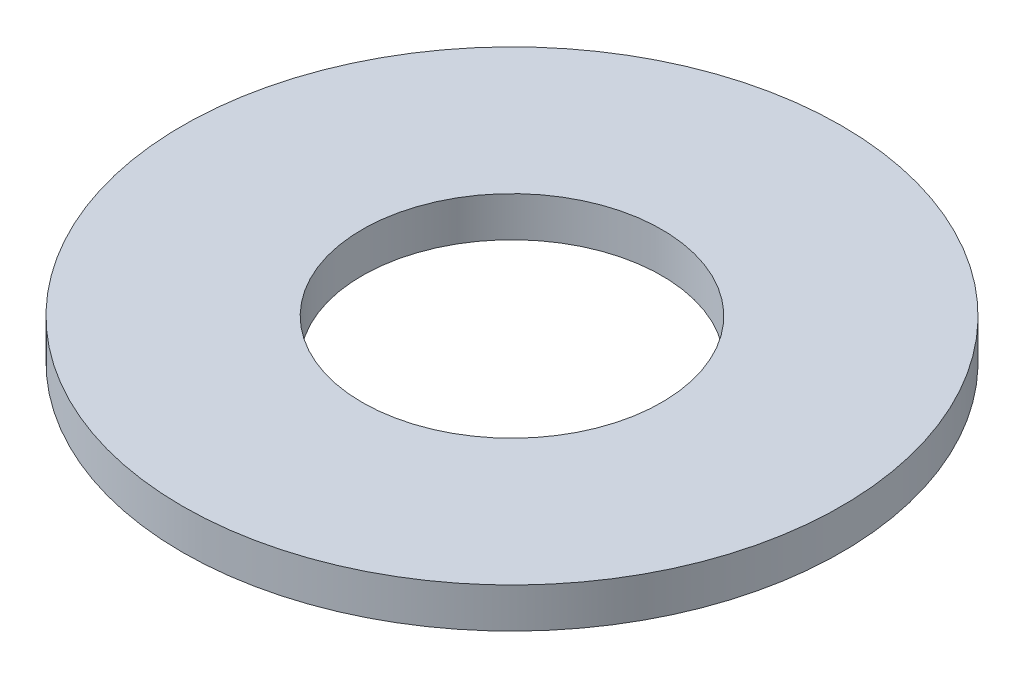
ISO-10303-21;
HEADER;
FILE_DESCRIPTION(('STEP AP214'),'2;1');
FILE_NAME('part.step','',(''),(''),'','','');
FILE_SCHEMA(('AUTOMOTIVE_DESIGN { 1 0 10303 214 1 1 1 1 }'));
ENDSEC;
DATA;
#1=APPLICATION_CONTEXT('core data for automotive mechanical design processes');
#2=APPLICATION_PROTOCOL_DEFINITION('international standard','automotive_design',2000,#1);
#3=PRODUCT_CONTEXT('',#1,'mechanical');
#4=PRODUCT('Part','Part','',(#3));
#5=PRODUCT_RELATED_PRODUCT_CATEGORY('part','',(#4));
#6=PRODUCT_DEFINITION_FORMATION('','',#4);
#7=PRODUCT_DEFINITION_CONTEXT('part definition',#1,'design');
#8=PRODUCT_DEFINITION('design','',#6,#7);
#9=PRODUCT_DEFINITION_SHAPE('','',#8);
#10=(LENGTH_UNIT() NAMED_UNIT(*) SI_UNIT(.MILLI.,.METRE.));
#11=(NAMED_UNIT(*) PLANE_ANGLE_UNIT() SI_UNIT($,.RADIAN.));
#12=(NAMED_UNIT(*) SI_UNIT($,.STERADIAN.) SOLID_ANGLE_UNIT());
#13=UNCERTAINTY_MEASURE_WITH_UNIT(LENGTH_MEASURE(1.E-05),#10,'distance_accuracy_value','');
#14=(GEOMETRIC_REPRESENTATION_CONTEXT(3) GLOBAL_UNCERTAINTY_ASSIGNED_CONTEXT((#13)) GLOBAL_UNIT_ASSIGNED_CONTEXT((#10,
#11,#12)) REPRESENTATION_CONTEXT('',''));
#15=CARTESIAN_POINT('',(0.,0.,0.));
#16=DIRECTION('',(0.,0.,1.));
#17=DIRECTION('',(1.,0.,0.));
#18=AXIS2_PLACEMENT_3D('',#15,#16,#17);
#19=CARTESIAN_POINT('',(0.,10.,0.));
#20=DIRECTION('',(0.,-1.,0.));
#21=DIRECTION('',(0.,0.,-1.));
#22=AXIS2_PLACEMENT_3D('',#19,#20,#21);
#23=CYLINDRICAL_SURFACE('',#22,82.5);
#24=CARTESIAN_POINT('',(0.,10.,0.));
#25=DIRECTION('',(0.,1.,0.));
#26=DIRECTION('',(0.,0.,1.));
#27=AXIS2_PLACEMENT_3D('',#24,#25,#26);
#28=CIRCLE('',#27,82.5);
#29=CARTESIAN_POINT('',(0.,10.,82.5));
#30=VERTEX_POINT('',#29);
#31=EDGE_CURVE('E10',#30,#30,#28,.T.);
#32=ORIENTED_EDGE('',*,*,#31,.F.);
#33=EDGE_LOOP('',(#32));
#34=FACE_BOUND('',#33,.T.);
#35=CARTESIAN_POINT('',(0.,0.,0.));
#36=DIRECTION('',(0.,1.,0.));
#37=DIRECTION('',(0.,0.,1.));
#38=AXIS2_PLACEMENT_3D('',#35,#36,#37);
#39=CIRCLE('',#38,82.5);
#40=CARTESIAN_POINT('',(0.,0.,82.5));
#41=VERTEX_POINT('',#40);
#42=EDGE_CURVE('E37',#41,#41,#39,.T.);
#43=ORIENTED_EDGE('',*,*,#42,.T.);
#44=EDGE_LOOP('',(#43));
#45=FACE_BOUND('',#44,.T.);
#46=ADVANCED_FACE('F40',(#34,#45),#23,.T.);
#47=CARTESIAN_POINT('',(0.,10.,0.));
#48=DIRECTION('',(0.,1.,0.));
#49=DIRECTION('',(0.,0.,1.));
#50=AXIS2_PLACEMENT_3D('',#47,#48,#49);
#51=PLANE('',#50);
#52=CARTESIAN_POINT('',(0.,10.,0.));
#53=DIRECTION('',(0.,1.,0.));
#54=DIRECTION('',(0.,0.,1.));
#55=AXIS2_PLACEMENT_3D('',#52,#53,#54);
#56=CIRCLE('',#55,37.5);
#57=CARTESIAN_POINT('',(0.,10.,37.5));
#58=VERTEX_POINT('',#57);
#59=EDGE_CURVE('E50',#58,#58,#56,.T.);
#60=ORIENTED_EDGE('',*,*,#59,.F.);
#61=EDGE_LOOP('',(#60));
#62=FACE_BOUND('',#61,.T.);
#63=ORIENTED_EDGE('',*,*,#31,.T.);
#64=EDGE_LOOP('',(#63));
#65=FACE_BOUND('',#64,.T.);
#66=ADVANCED_FACE('F59',(#62,#65),#51,.T.);
#67=CARTESIAN_POINT('',(0.,0.,0.));
#68=DIRECTION('',(0.,1.,0.));
#69=DIRECTION('',(0.,0.,1.));
#70=AXIS2_PLACEMENT_3D('',#67,#68,#69);
#71=PLANE('',#70);
#72=CARTESIAN_POINT('',(0.,0.,0.));
#73=DIRECTION('',(0.,1.,0.));
#74=DIRECTION('',(0.,0.,1.));
#75=AXIS2_PLACEMENT_3D('',#72,#73,#74);
#76=CIRCLE('',#75,37.5);
#77=CARTESIAN_POINT('',(0.,0.,37.5));
#78=VERTEX_POINT('',#77);
#79=EDGE_CURVE('E47',#78,#78,#76,.T.);
#80=ORIENTED_EDGE('',*,*,#79,.T.);
#81=EDGE_LOOP('',(#80));
#82=FACE_BOUND('',#81,.T.);
#83=ORIENTED_EDGE('',*,*,#42,.F.);
#84=EDGE_LOOP('',(#83));
#85=FACE_BOUND('',#84,.T.);
#86=ADVANCED_FACE('F58',(#82,#85),#71,.F.);
#87=CARTESIAN_POINT('',(0.,10.,0.));
#88=DIRECTION('',(0.,-1.,0.));
#89=DIRECTION('',(0.,0.,-1.));
#90=AXIS2_PLACEMENT_3D('',#87,#88,#89);
#91=CYLINDRICAL_SURFACE('',#90,37.5);
#92=ORIENTED_EDGE('',*,*,#59,.T.);
#93=EDGE_LOOP('',(#92));
#94=FACE_BOUND('',#93,.T.);
#95=ORIENTED_EDGE('',*,*,#79,.F.);
#96=EDGE_LOOP('',(#95));
#97=FACE_BOUND('',#96,.T.);
#98=ADVANCED_FACE('F54',(#94,#97),#91,.F.);
#99=CLOSED_SHELL('',(#46,#66,#86,#98));
#100=MANIFOLD_SOLID_BREP('B2',#99);
#101=ADVANCED_BREP_SHAPE_REPRESENTATION('',(#18,#100),#14);
#102=SHAPE_DEFINITION_REPRESENTATION(#9,#101);
ENDSEC;
END-ISO-10303-21;
